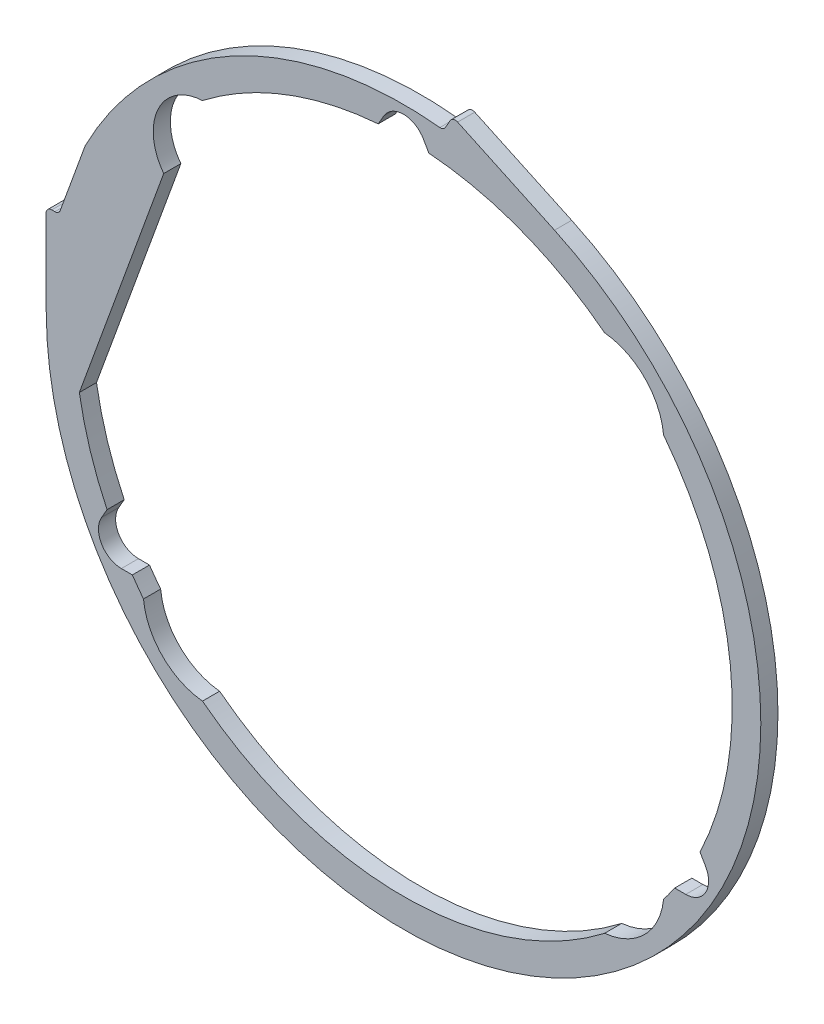
ISO-10303-21;
HEADER;
FILE_DESCRIPTION(('STEP AP214'),'2;1');
FILE_NAME('part.step','',(''),(''),'','','');
FILE_SCHEMA(('AUTOMOTIVE_DESIGN { 1 0 10303 214 1 1 1 1 }'));
ENDSEC;
DATA;
#1=APPLICATION_CONTEXT('core data for automotive mechanical design processes');
#2=APPLICATION_PROTOCOL_DEFINITION('international standard','automotive_design',2000,#1);
#3=PRODUCT_CONTEXT('',#1,'mechanical');
#4=PRODUCT('Part','Part','',(#3));
#5=PRODUCT_RELATED_PRODUCT_CATEGORY('part','',(#4));
#6=PRODUCT_DEFINITION_FORMATION('','',#4);
#7=PRODUCT_DEFINITION_CONTEXT('part definition',#1,'design');
#8=PRODUCT_DEFINITION('design','',#6,#7);
#9=PRODUCT_DEFINITION_SHAPE('','',#8);
#10=(LENGTH_UNIT() NAMED_UNIT(*) SI_UNIT(.MILLI.,.METRE.));
#11=(NAMED_UNIT(*) PLANE_ANGLE_UNIT() SI_UNIT($,.RADIAN.));
#12=(NAMED_UNIT(*) SI_UNIT($,.STERADIAN.) SOLID_ANGLE_UNIT());
#13=UNCERTAINTY_MEASURE_WITH_UNIT(LENGTH_MEASURE(1.E-05),#10,'distance_accuracy_value','');
#14=(GEOMETRIC_REPRESENTATION_CONTEXT(3) GLOBAL_UNCERTAINTY_ASSIGNED_CONTEXT((#13)) GLOBAL_UNIT_ASSIGNED_CONTEXT((#10,
#11,#12)) REPRESENTATION_CONTEXT('',''));
#15=CARTESIAN_POINT('',(0.,0.,0.));
#16=DIRECTION('',(0.,0.,1.));
#17=DIRECTION('',(1.,0.,0.));
#18=AXIS2_PLACEMENT_3D('',#15,#16,#17);
#19=CARTESIAN_POINT('',(-120.579344739041,31.5,5.99999999999995));
#20=DIRECTION('',(-0.939692620785907,0.342020143325672,0.));
#21=DIRECTION('',(-0.342020143325672,-0.939692620785907,0.));
#22=AXIS2_PLACEMENT_3D('',#19,#20,#21);
#23=PLANE('',#22);
#24=DIRECTION('',(0.,0.,1.));
#25=VECTOR('',#24,1.);
#26=CARTESIAN_POINT('',(-111.465659693336,56.5396438710967,5.99999999999995));
#27=LINE('',#26,#25);
#28=CARTESIAN_POINT('',(-111.465659693336,56.5396438710967,0.));
#29=VERTEX_POINT('',#28);
#30=CARTESIAN_POINT('',(-111.465659693336,56.5396438710967,5.99999999999995));
#31=VERTEX_POINT('',#30);
#32=EDGE_CURVE('E11',#29,#31,#27,.T.);
#33=ORIENTED_EDGE('',*,*,#32,.F.);
#34=DIRECTION('',(-0.342020143325672,-0.939692620785907,0.));
#35=VECTOR('',#34,1.);
#36=CARTESIAN_POINT('',(-120.579344739041,31.5,0.));
#37=LINE('',#36,#35);
#38=CARTESIAN_POINT('',(-120.100374573889,32.8159597133486,0.));
#39=VERTEX_POINT('',#38);
#40=EDGE_CURVE('E186',#29,#39,#37,.T.);
#41=ORIENTED_EDGE('',*,*,#40,.T.);
#42=DIRECTION('',(0.,0.,1.));
#43=VECTOR('',#42,1.);
#44=CARTESIAN_POINT('',(-120.100374573889,32.8159597133486,6.00000000000006));
#45=LINE('',#44,#43);
#46=CARTESIAN_POINT('',(-120.100374573889,32.8159597133486,6.00000000000006));
#47=VERTEX_POINT('',#46);
#48=EDGE_CURVE('E53',#39,#47,#45,.T.);
#49=ORIENTED_EDGE('',*,*,#48,.T.);
#50=DIRECTION('',(-0.342020143325672,-0.939692620785907,0.));
#51=VECTOR('',#50,1.);
#52=CARTESIAN_POINT('',(-120.579344739041,31.5,5.99999999999995));
#53=LINE('',#52,#51);
#54=EDGE_CURVE('E331',#31,#47,#53,.T.);
#55=ORIENTED_EDGE('',*,*,#54,.F.);
#56=EDGE_LOOP('',(#33,#41,#49,#55));
#57=FACE_BOUND('',#56,.T.);
#58=ADVANCED_FACE('F43',(#57),#23,.T.);
#59=CARTESIAN_POINT('',(-121.97975981546,33.5,6.00000000000001));
#60=DIRECTION('',(0.,0.,1.));
#61=DIRECTION('',(1.,0.,0.));
#62=AXIS2_PLACEMENT_3D('',#59,#60,#61);
#63=CYLINDRICAL_SURFACE('',#62,2.);
#64=ORIENTED_EDGE('',*,*,#48,.F.);
#65=CARTESIAN_POINT('',(-121.97975981546,33.5,0.));
#66=DIRECTION('',(0.,0.,1.));
#67=DIRECTION('',(1.,0.,0.));
#68=AXIS2_PLACEMENT_3D('',#65,#66,#67);
#69=CIRCLE('',#68,2.);
#70=CARTESIAN_POINT('',(-121.97975981546,31.5,0.));
#71=VERTEX_POINT('',#70);
#72=EDGE_CURVE('E234',#39,#71,#69,.F.);
#73=ORIENTED_EDGE('',*,*,#72,.T.);
#74=DIRECTION('',(0.,0.,1.));
#75=VECTOR('',#74,1.);
#76=CARTESIAN_POINT('',(-121.97975981546,31.5,6.00000000000001));
#77=LINE('',#76,#75);
#78=CARTESIAN_POINT('',(-121.97975981546,31.5,6.00000000000001));
#79=VERTEX_POINT('',#78);
#80=EDGE_CURVE('E324',#71,#79,#77,.T.);
#81=ORIENTED_EDGE('',*,*,#80,.T.);
#82=CARTESIAN_POINT('',(-121.97975981546,33.5,6.00000000000001));
#83=DIRECTION('',(0.,0.,1.));
#84=DIRECTION('',(1.,0.,0.));
#85=AXIS2_PLACEMENT_3D('',#82,#83,#84);
#86=CIRCLE('',#85,2.);
#87=EDGE_CURVE('E340',#47,#79,#86,.F.);
#88=ORIENTED_EDGE('',*,*,#87,.F.);
#89=EDGE_LOOP('',(#64,#73,#81,#88));
#90=FACE_BOUND('',#89,.T.);
#91=ADVANCED_FACE('F344',(#90),#63,.F.);
#92=CARTESIAN_POINT('',(-120.579344739041,31.5,5.99999999999995));
#93=DIRECTION('',(0.,1.,0.));
#94=DIRECTION('',(-1.,0.,0.));
#95=AXIS2_PLACEMENT_3D('',#92,#93,#94);
#96=PLANE('',#95);
#97=ORIENTED_EDGE('',*,*,#80,.F.);
#98=DIRECTION('',(1.,0.,0.));
#99=VECTOR('',#98,1.);
#100=CARTESIAN_POINT('',(0.,31.5,0.));
#101=LINE('',#100,#99);
#102=CARTESIAN_POINT('',(-123.074325624735,31.5,0.));
#103=VERTEX_POINT('',#102);
#104=EDGE_CURVE('E230',#71,#103,#101,.F.);
#105=ORIENTED_EDGE('',*,*,#104,.T.);
#106=DIRECTION('',(0.,0.,1.));
#107=VECTOR('',#106,1.);
#108=CARTESIAN_POINT('',(-123.074325624735,31.5,6.00000000000006));
#109=LINE('',#108,#107);
#110=CARTESIAN_POINT('',(-123.074325624735,31.5,6.00000000000006));
#111=VERTEX_POINT('',#110);
#112=EDGE_CURVE('E321',#103,#111,#109,.T.);
#113=ORIENTED_EDGE('',*,*,#112,.T.);
#114=DIRECTION('',(-1.,0.,0.));
#115=VECTOR('',#114,1.);
#116=CARTESIAN_POINT('',(-120.579344739041,31.5,5.99999999999995));
#117=LINE('',#116,#115);
#118=EDGE_CURVE('E346',#79,#111,#117,.T.);
#119=ORIENTED_EDGE('',*,*,#118,.F.);
#120=EDGE_LOOP('',(#97,#105,#113,#119));
#121=FACE_BOUND('',#120,.T.);
#122=ADVANCED_FACE('F687',(#121),#96,.T.);
#123=CARTESIAN_POINT('',(-123.074325624735,29.5,6.00000000000006));
#124=DIRECTION('',(0.,0.,1.));
#125=DIRECTION('',(1.,0.,0.));
#126=AXIS2_PLACEMENT_3D('',#123,#124,#125);
#127=CYLINDRICAL_SURFACE('',#126,2.);
#128=ORIENTED_EDGE('',*,*,#112,.F.);
#129=CARTESIAN_POINT('',(-123.074325624735,29.5,0.));
#130=DIRECTION('',(0.,0.,1.));
#131=DIRECTION('',(1.,0.,0.));
#132=AXIS2_PLACEMENT_3D('',#129,#130,#131);
#133=CIRCLE('',#132,2.);
#134=CARTESIAN_POINT('',(-125.074319342643,29.4949871835515,0.));
#135=VERTEX_POINT('',#134);
#136=EDGE_CURVE('E226',#103,#135,#133,.T.);
#137=ORIENTED_EDGE('',*,*,#136,.T.);
#138=DIRECTION('',(0.,0.,1.));
#139=VECTOR('',#138,1.);
#140=CARTESIAN_POINT('',(-125.074319342643,29.4949871835515,6.00000000000001));
#141=LINE('',#140,#139);
#142=CARTESIAN_POINT('',(-125.074319342643,29.4949871835515,6.00000000000001));
#143=VERTEX_POINT('',#142);
#144=EDGE_CURVE('E318',#135,#143,#141,.T.);
#145=ORIENTED_EDGE('',*,*,#144,.T.);
#146=CARTESIAN_POINT('',(-123.074325624735,29.5,6.00000000000006));
#147=DIRECTION('',(0.,0.,1.));
#148=DIRECTION('',(1.,0.,0.));
#149=AXIS2_PLACEMENT_3D('',#146,#147,#148);
#150=CIRCLE('',#149,2.);
#151=EDGE_CURVE('E350',#111,#143,#150,.T.);
#152=ORIENTED_EDGE('',*,*,#151,.F.);
#153=EDGE_LOOP('',(#128,#137,#145,#152));
#154=FACE_BOUND('',#153,.T.);
#155=ADVANCED_FACE('F692',(#154),#127,.T.);
#156=CARTESIAN_POINT('',(-125.079344739041,31.5,6.00000000000006));
#157=DIRECTION('',(-0.999996858953974,-0.00250640822420062,0.));
#158=DIRECTION('',(0.00250640822420062,-0.999996858953974,0.));
#159=AXIS2_PLACEMENT_3D('',#156,#157,#158);
#160=PLANE('',#159);
#161=ORIENTED_EDGE('',*,*,#144,.F.);
#162=DIRECTION('',(0.00250640822420062,-0.999996858953974,0.));
#163=VECTOR('',#162,1.);
#164=CARTESIAN_POINT('',(-125.079344739041,31.5,0.));
#165=LINE('',#164,#163);
#166=CARTESIAN_POINT('',(-124.999607369247,-0.31330102802507,0.));
#167=VERTEX_POINT('',#166);
#168=EDGE_CURVE('E222',#135,#167,#165,.T.);
#169=ORIENTED_EDGE('',*,*,#168,.T.);
#170=DIRECTION('',(0.,0.,1.));
#171=VECTOR('',#170,1.);
#172=CARTESIAN_POINT('',(-124.999607369247,-0.31330102802507,6.00000000000001));
#173=LINE('',#172,#171);
#174=CARTESIAN_POINT('',(-124.999607369247,-0.31330102802507,6.00000000000001));
#175=VERTEX_POINT('',#174);
#176=EDGE_CURVE('E315',#167,#175,#173,.T.);
#177=ORIENTED_EDGE('',*,*,#176,.T.);
#178=DIRECTION('',(0.00250640822420062,-0.999996858953974,0.));
#179=VECTOR('',#178,1.);
#180=CARTESIAN_POINT('',(-125.079344739041,31.5,6.00000000000006));
#181=LINE('',#180,#179);
#182=EDGE_CURVE('E357',#143,#175,#181,.T.);
#183=ORIENTED_EDGE('',*,*,#182,.F.);
#184=EDGE_LOOP('',(#161,#169,#177,#183));
#185=FACE_BOUND('',#184,.T.);
#186=ADVANCED_FACE('F696',(#185),#160,.T.);
#187=CARTESIAN_POINT('',(0.,0.,6.00000000000001));
#188=DIRECTION('',(0.,0.,1.));
#189=DIRECTION('',(1.,0.,0.));
#190=AXIS2_PLACEMENT_3D('',#187,#188,#189);
#191=CYLINDRICAL_SURFACE('',#190,125.);
#192=ORIENTED_EDGE('',*,*,#176,.F.);
#193=CARTESIAN_POINT('',(0.,0.,0.));
#194=DIRECTION('',(0.,0.,1.));
#195=DIRECTION('',(1.,0.,0.));
#196=AXIS2_PLACEMENT_3D('',#193,#194,#195);
#197=CIRCLE('',#196,125.);
#198=CARTESIAN_POINT('',(52.8272827175867,113.288473379582,0.));
#199=VERTEX_POINT('',#198);
#200=EDGE_CURVE('E218',#167,#199,#197,.T.);
#201=ORIENTED_EDGE('',*,*,#200,.T.);
#202=DIRECTION('',(0.,0.,1.));
#203=VECTOR('',#202,1.);
#204=CARTESIAN_POINT('',(52.8272827175867,113.288473379582,6.00000000000001));
#205=LINE('',#204,#203);
#206=CARTESIAN_POINT('',(52.8272827175867,113.288473379582,6.00000000000001));
#207=VERTEX_POINT('',#206);
#208=EDGE_CURVE('E312',#199,#207,#205,.T.);
#209=ORIENTED_EDGE('',*,*,#208,.T.);
#210=CARTESIAN_POINT('',(0.,0.,6.00000000000001));
#211=DIRECTION('',(0.,0.,1.));
#212=DIRECTION('',(-1.,0.,0.));
#213=AXIS2_PLACEMENT_3D('',#210,#211,#212);
#214=CIRCLE('',#213,125.);
#215=EDGE_CURVE('E361',#175,#207,#214,.T.);
#216=ORIENTED_EDGE('',*,*,#215,.F.);
#217=EDGE_LOOP('',(#192,#201,#209,#216));
#218=FACE_BOUND('',#217,.T.);
#219=ADVANCED_FACE('F700',(#218),#191,.T.);
#220=CARTESIAN_POINT('',(52.8272827175867,113.288473379582,5.99999999999995));
#221=DIRECTION('',(0.422618261740693,0.906307787036653,0.));
#222=DIRECTION('',(-0.906307787036653,0.422618261740693,0.));
#223=AXIS2_PLACEMENT_3D('',#220,#221,#222);
#224=PLANE('',#223);
#225=ORIENTED_EDGE('',*,*,#208,.F.);
#226=DIRECTION('',(-0.906307787036653,0.422618261740693,0.));
#227=VECTOR('',#226,1.);
#228=CARTESIAN_POINT('',(52.8272827175867,113.288473379582,0.));
#229=LINE('',#228,#227);
#230=CARTESIAN_POINT('',(18.9272145650923,129.096334771066,0.));
#231=VERTEX_POINT('',#230);
#232=EDGE_CURVE('E214',#199,#231,#229,.T.);
#233=ORIENTED_EDGE('',*,*,#232,.T.);
#234=DIRECTION('',(0.,0.,1.));
#235=VECTOR('',#234,1.);
#236=CARTESIAN_POINT('',(18.9272145650923,129.096334771066,5.99999999999995));
#237=LINE('',#236,#235);
#238=CARTESIAN_POINT('',(18.9272145650923,129.096334771066,5.99999999999995));
#239=VERTEX_POINT('',#238);
#240=EDGE_CURVE('E309',#231,#239,#237,.T.);
#241=ORIENTED_EDGE('',*,*,#240,.T.);
#242=DIRECTION('',(-0.906307787036653,0.422618261740693,0.));
#243=VECTOR('',#242,1.);
#244=CARTESIAN_POINT('',(52.8272827175867,113.288473379582,5.99999999999995));
#245=LINE('',#244,#243);
#246=EDGE_CURVE('E365',#207,#239,#245,.T.);
#247=ORIENTED_EDGE('',*,*,#246,.F.);
#248=EDGE_LOOP('',(#225,#233,#241,#247));
#249=FACE_BOUND('',#248,.T.);
#250=ADVANCED_FACE('F704',(#249),#224,.T.);
#251=CARTESIAN_POINT('',(18.0819780416109,127.283719196992,6.00000000000001));
#252=DIRECTION('',(0.,0.,1.));
#253=DIRECTION('',(1.,0.,0.));
#254=AXIS2_PLACEMENT_3D('',#251,#252,#253);
#255=CYLINDRICAL_SURFACE('',#254,2.);
#256=ORIENTED_EDGE('',*,*,#240,.F.);
#257=CARTESIAN_POINT('',(18.0819780416109,127.283719196992,0.));
#258=DIRECTION('',(0.,0.,1.));
#259=DIRECTION('',(1.,0.,0.));
#260=AXIS2_PLACEMENT_3D('',#257,#258,#259);
#261=CIRCLE('',#260,2.);
#262=CARTESIAN_POINT('',(16.349927234042,128.283719196993,0.));
#263=VERTEX_POINT('',#262);
#264=EDGE_CURVE('E210',#231,#263,#261,.T.);
#265=ORIENTED_EDGE('',*,*,#264,.T.);
#266=DIRECTION('',(0.,0.,1.));
#267=VECTOR('',#266,1.);
#268=CARTESIAN_POINT('',(16.349927234042,128.283719196993,6.00000000000001));
#269=LINE('',#268,#267);
#270=CARTESIAN_POINT('',(16.349927234042,128.283719196993,6.00000000000001));
#271=VERTEX_POINT('',#270);
#272=EDGE_CURVE('E306',#263,#271,#269,.T.);
#273=ORIENTED_EDGE('',*,*,#272,.T.);
#274=CARTESIAN_POINT('',(18.0819780416109,127.283719196992,6.00000000000001));
#275=DIRECTION('',(0.,0.,1.));
#276=DIRECTION('',(1.,0.,0.));
#277=AXIS2_PLACEMENT_3D('',#274,#275,#276);
#278=CIRCLE('',#277,2.);
#279=EDGE_CURVE('E369',#239,#271,#278,.T.);
#280=ORIENTED_EDGE('',*,*,#279,.F.);
#281=EDGE_LOOP('',(#256,#265,#273,#280));
#282=FACE_BOUND('',#281,.T.);
#283=ADVANCED_FACE('F484',(#282),#255,.T.);
#284=CARTESIAN_POINT('',(14.,124.213525833542,6.00000000000001));
#285=DIRECTION('',(-0.866025403784437,0.500000000000004,0.));
#286=DIRECTION('',(-0.500000000000004,-0.866025403784437,0.));
#287=AXIS2_PLACEMENT_3D('',#284,#285,#286);
#288=PLANE('',#287);
#289=ORIENTED_EDGE('',*,*,#272,.F.);
#290=DIRECTION('',(-0.500000000000004,-0.866025403784437,0.));
#291=VECTOR('',#290,1.);
#292=CARTESIAN_POINT('',(14.,124.213525833542,0.));
#293=LINE('',#292,#291);
#294=CARTESIAN_POINT('',(14.6510636458252,125.341201147072,0.));
#295=VERTEX_POINT('',#294);
#296=EDGE_CURVE('E206',#263,#295,#293,.T.);
#297=ORIENTED_EDGE('',*,*,#296,.T.);
#298=DIRECTION('',(0.,0.,1.));
#299=VECTOR('',#298,1.);
#300=CARTESIAN_POINT('',(14.6510636458252,125.341201147072,6.00000000000001));
#301=LINE('',#300,#299);
#302=CARTESIAN_POINT('',(14.6510636458252,125.341201147072,6.00000000000001));
#303=VERTEX_POINT('',#302);
#304=EDGE_CURVE('E304',#295,#303,#301,.T.);
#305=ORIENTED_EDGE('',*,*,#304,.T.);
#306=DIRECTION('',(-0.500000000000004,-0.866025403784437,0.));
#307=VECTOR('',#306,1.);
#308=CARTESIAN_POINT('',(14.,124.213525833542,6.00000000000001));
#309=LINE('',#308,#307);
#310=EDGE_CURVE('E373',#271,#303,#309,.T.);
#311=ORIENTED_EDGE('',*,*,#310,.F.);
#312=EDGE_LOOP('',(#289,#297,#305,#311));
#313=FACE_BOUND('',#312,.T.);
#314=ADVANCED_FACE('F490',(#313),#288,.T.);
#315=CARTESIAN_POINT('',(12.9190128382564,126.341201147072,6.00000000000001));
#316=DIRECTION('',(0.,0.,1.));
#317=DIRECTION('',(1.,0.,0.));
#318=AXIS2_PLACEMENT_3D('',#315,#316,#317);
#319=CYLINDRICAL_SURFACE('',#318,2.);
#320=ORIENTED_EDGE('',*,*,#304,.F.);
#321=CARTESIAN_POINT('',(12.9190128382564,126.341201147072,0.));
#322=DIRECTION('',(0.,0.,1.));
#323=DIRECTION('',(1.,0.,0.));
#324=AXIS2_PLACEMENT_3D('',#321,#322,#323);
#325=CIRCLE('',#324,2.);
#326=CARTESIAN_POINT('',(12.7155638171814,124.351575932158,0.));
#327=VERTEX_POINT('',#326);
#328=EDGE_CURVE('E202',#295,#327,#325,.F.);
#329=ORIENTED_EDGE('',*,*,#328,.T.);
#330=DIRECTION('',(0.,0.,1.));
#331=VECTOR('',#330,1.);
#332=CARTESIAN_POINT('',(12.7155638171814,124.351575932158,6.00000000000001));
#333=LINE('',#332,#331);
#334=CARTESIAN_POINT('',(12.7155638171814,124.351575932158,6.00000000000001));
#335=VERTEX_POINT('',#334);
#336=EDGE_CURVE('E61',#327,#335,#333,.T.);
#337=ORIENTED_EDGE('',*,*,#336,.T.);
#338=CARTESIAN_POINT('',(12.9190128382564,126.341201147072,6.00000000000001));
#339=DIRECTION('',(0.,0.,1.));
#340=DIRECTION('',(1.,0.,0.));
#341=AXIS2_PLACEMENT_3D('',#338,#339,#340);
#342=CIRCLE('',#341,2.);
#343=EDGE_CURVE('E302',#303,#335,#342,.F.);
#344=ORIENTED_EDGE('',*,*,#343,.F.);
#345=EDGE_LOOP('',(#320,#329,#337,#344));
#346=FACE_BOUND('',#345,.T.);
#347=ADVANCED_FACE('F491',(#346),#319,.F.);
#348=CARTESIAN_POINT('',(0.,0.,6.00000000000001));
#349=DIRECTION('',(0.,0.,1.));
#350=DIRECTION('',(1.,0.,0.));
#351=AXIS2_PLACEMENT_3D('',#348,#349,#350);
#352=CYLINDRICAL_SURFACE('',#351,125.);
#353=ORIENTED_EDGE('',*,*,#336,.F.);
#354=CARTESIAN_POINT('',(0.,0.,0.));
#355=DIRECTION('',(0.,0.,1.));
#356=DIRECTION('',(1.,0.,0.));
#357=AXIS2_PLACEMENT_3D('',#354,#355,#356);
#358=CIRCLE('',#357,125.);
#359=CARTESIAN_POINT('',(-111.368165093256,56.7638247809404,0.));
#360=VERTEX_POINT('',#359);
#361=EDGE_CURVE('E184',#327,#360,#358,.T.);
#362=ORIENTED_EDGE('',*,*,#361,.T.);
#363=DIRECTION('',(0.,0.,1.));
#364=VECTOR('',#363,1.);
#365=CARTESIAN_POINT('',(-111.368165093256,56.7638247809404,6.00000000000001));
#366=LINE('',#365,#364);
#367=CARTESIAN_POINT('',(-111.368165093256,56.7638247809404,6.00000000000001));
#368=VERTEX_POINT('',#367);
#369=EDGE_CURVE('E47',#360,#368,#366,.T.);
#370=ORIENTED_EDGE('',*,*,#369,.T.);
#371=CARTESIAN_POINT('',(0.,0.,6.00000000000001));
#372=DIRECTION('',(0.,0.,1.));
#373=DIRECTION('',(1.,0.,0.));
#374=AXIS2_PLACEMENT_3D('',#371,#372,#373);
#375=CIRCLE('',#374,125.);
#376=EDGE_CURVE('E492',#335,#368,#375,.T.);
#377=ORIENTED_EDGE('',*,*,#376,.F.);
#378=EDGE_LOOP('',(#353,#362,#370,#377));
#379=FACE_BOUND('',#378,.T.);
#380=ADVANCED_FACE('F189',(#379),#352,.T.);
#381=CARTESIAN_POINT('',(-83.90361394427,62.0944365967156,6.00000000000001));
#382=DIRECTION('',(-0.939692620785907,0.342020143325672,0.));
#383=DIRECTION('',(-0.342020143325672,-0.939692620785907,0.));
#384=AXIS2_PLACEMENT_3D('',#381,#382,#383);
#385=PLANE('',#384);
#386=DIRECTION('',(0.,0.,1.));
#387=VECTOR('',#386,1.);
#388=CARTESIAN_POINT('',(-113.419575030063,-19.,6.00000000000001));
#389=LINE('',#388,#387);
#390=CARTESIAN_POINT('',(-113.419575030063,-19.,0.));
#391=VERTEX_POINT('',#390);
#392=CARTESIAN_POINT('',(-113.419575030063,-19.,6.00000000000001));
#393=VERTEX_POINT('',#392);
#394=EDGE_CURVE('E179',#391,#393,#389,.T.);
#395=ORIENTED_EDGE('',*,*,#394,.F.);
#396=DIRECTION('',(-0.342020143325672,-0.939692620785907,0.));
#397=VECTOR('',#396,1.);
#398=CARTESIAN_POINT('',(-83.90361394427,62.0944365967156,0.));
#399=LINE('',#398,#397);
#400=CARTESIAN_POINT('',(-83.90361394427,62.0944365967156,0.));
#401=VERTEX_POINT('',#400);
#402=EDGE_CURVE('E441',#401,#391,#399,.T.);
#403=ORIENTED_EDGE('',*,*,#402,.F.);
#404=DIRECTION('',(0.,0.,1.));
#405=VECTOR('',#404,1.);
#406=CARTESIAN_POINT('',(-83.90361394427,62.0944365967156,6.00000000000001));
#407=LINE('',#406,#405);
#408=CARTESIAN_POINT('',(-83.90361394427,62.0944365967156,6.00000000000001));
#409=VERTEX_POINT('',#408);
#410=EDGE_CURVE('E295',#401,#409,#407,.T.);
#411=ORIENTED_EDGE('',*,*,#410,.T.);
#412=DIRECTION('',(-0.342020143325672,-0.939692620785907,0.));
#413=VECTOR('',#412,1.);
#414=CARTESIAN_POINT('',(-83.90361394427,62.0944365967156,6.00000000000001));
#415=LINE('',#414,#413);
#416=EDGE_CURVE('E537',#409,#393,#415,.T.);
#417=ORIENTED_EDGE('',*,*,#416,.T.);
#418=EDGE_LOOP('',(#395,#403,#411,#417));
#419=FACE_BOUND('',#418,.T.);
#420=ADVANCED_FACE('F625',(#419),#385,.F.);
#421=CARTESIAN_POINT('',(-69.5775173450919,72.9922784120026,6.00000000000001));
#422=DIRECTION('',(0.,0.,1.));
#423=DIRECTION('',(1.,0.,0.));
#424=AXIS2_PLACEMENT_3D('',#421,#422,#423);
#425=CYLINDRICAL_SURFACE('',#424,18.);
#426=ORIENTED_EDGE('',*,*,#410,.F.);
#427=CARTESIAN_POINT('',(-69.5775173450919,72.9922784120026,0.));
#428=DIRECTION('',(0.,0.,-1.));
#429=DIRECTION('',(-1.,0.,0.));
#430=AXIS2_PLACEMENT_3D('',#427,#428,#429);
#431=CIRCLE('',#430,18.);
#432=CARTESIAN_POINT('',(-70.3447363216833,90.9759202857155,0.));
#433=VERTEX_POINT('',#432);
#434=EDGE_CURVE('E438',#433,#401,#431,.F.);
#435=ORIENTED_EDGE('',*,*,#434,.F.);
#436=DIRECTION('',(0.,0.,1.));
#437=VECTOR('',#436,1.);
#438=CARTESIAN_POINT('',(-70.3447363216833,90.9759202857155,6.00000000000001));
#439=LINE('',#438,#437);
#440=CARTESIAN_POINT('',(-70.3447363216833,90.9759202857155,6.00000000000001));
#441=VERTEX_POINT('',#440);
#442=EDGE_CURVE('E292',#433,#441,#439,.T.);
#443=ORIENTED_EDGE('',*,*,#442,.T.);
#444=CARTESIAN_POINT('',(-69.5775173450919,72.9922784120026,6.00000000000001));
#445=DIRECTION('',(0.,0.,-1.));
#446=DIRECTION('',(-1.,0.,0.));
#447=AXIS2_PLACEMENT_3D('',#444,#445,#446);
#448=CIRCLE('',#447,18.);
#449=EDGE_CURVE('E532',#441,#409,#448,.F.);
#450=ORIENTED_EDGE('',*,*,#449,.T.);
#451=EDGE_LOOP('',(#426,#435,#443,#450));
#452=FACE_BOUND('',#451,.T.);
#453=ADVANCED_FACE('F628',(#452),#425,.F.);
#454=CARTESIAN_POINT('',(0.,0.,6.00000000000001));
#455=DIRECTION('',(0.,0.,1.));
#456=DIRECTION('',(1.,0.,0.));
#457=AXIS2_PLACEMENT_3D('',#454,#455,#456);
#458=CYLINDRICAL_SURFACE('',#457,115.);
#459=ORIENTED_EDGE('',*,*,#442,.F.);
#460=CARTESIAN_POINT('',(0.,0.,0.));
#461=DIRECTION('',(0.,0.,1.));
#462=DIRECTION('',(1.,0.,0.));
#463=AXIS2_PLACEMENT_3D('',#460,#461,#462);
#464=CIRCLE('',#463,115.);
#465=CARTESIAN_POINT('',(-8.85748634346279,114.658383625775,0.));
#466=VERTEX_POINT('',#465);
#467=EDGE_CURVE('E434',#466,#433,#464,.T.);
#468=ORIENTED_EDGE('',*,*,#467,.F.);
#469=DIRECTION('',(0.,0.,1.));
#470=VECTOR('',#469,1.);
#471=CARTESIAN_POINT('',(-8.85748634346279,114.658383625775,6.00000000000006));
#472=LINE('',#471,#470);
#473=CARTESIAN_POINT('',(-8.85748634346279,114.658383625775,6.00000000000006));
#474=VERTEX_POINT('',#473);
#475=EDGE_CURVE('E289',#466,#474,#472,.T.);
#476=ORIENTED_EDGE('',*,*,#475,.T.);
#477=CARTESIAN_POINT('',(0.,0.,6.00000000000001));
#478=DIRECTION('',(0.,0.,1.));
#479=DIRECTION('',(-1.,0.,0.));
#480=AXIS2_PLACEMENT_3D('',#477,#478,#479);
#481=CIRCLE('',#480,115.);
#482=EDGE_CURVE('E536',#474,#441,#481,.T.);
#483=ORIENTED_EDGE('',*,*,#482,.T.);
#484=EDGE_LOOP('',(#459,#468,#476,#483));
#485=FACE_BOUND('',#484,.T.);
#486=ADVANCED_FACE('F632',(#485),#458,.F.);
#487=CARTESIAN_POINT('',(-105.655099261702,-53.,6.00000000000006));
#488=DIRECTION('',(0.866025403784439,-0.5,0.));
#489=DIRECTION('',(0.5,0.866025403784439,0.));
#490=AXIS2_PLACEMENT_3D('',#487,#488,#489);
#491=PLANE('',#490);
#492=ORIENTED_EDGE('',*,*,#475,.F.);
#493=DIRECTION('',(0.5,0.866025403784439,0.));
#494=VECTOR('',#493,1.);
#495=CARTESIAN_POINT('',(-105.655099261702,-53.,0.));
#496=LINE('',#495,#494);
#497=CARTESIAN_POINT('',(-6.9282032302755,118.,0.));
#498=VERTEX_POINT('',#497);
#499=EDGE_CURVE('E431',#466,#498,#496,.T.);
#500=ORIENTED_EDGE('',*,*,#499,.T.);
#501=DIRECTION('',(0.,0.,1.));
#502=VECTOR('',#501,1.);
#503=CARTESIAN_POINT('',(-6.9282032302755,118.,6.00000000000006));
#504=LINE('',#503,#502);
#505=CARTESIAN_POINT('',(-6.9282032302755,118.,6.00000000000006));
#506=VERTEX_POINT('',#505);
#507=EDGE_CURVE('E286',#498,#506,#504,.T.);
#508=ORIENTED_EDGE('',*,*,#507,.T.);
#509=DIRECTION('',(0.5,0.866025403784439,0.));
#510=VECTOR('',#509,1.);
#511=CARTESIAN_POINT('',(-105.655099261702,-53.,6.00000000000006));
#512=LINE('',#511,#510);
#513=EDGE_CURVE('E531',#474,#506,#512,.T.);
#514=ORIENTED_EDGE('',*,*,#513,.F.);
#515=EDGE_LOOP('',(#492,#500,#508,#514));
#516=FACE_BOUND('',#515,.T.);
#517=ADVANCED_FACE('F634',(#516),#491,.T.);
#518=CARTESIAN_POINT('',(0.,114.,6.00000000000006));
#519=DIRECTION('',(0.,0.,1.));
#520=DIRECTION('',(1.,0.,0.));
#521=AXIS2_PLACEMENT_3D('',#518,#519,#520);
#522=CYLINDRICAL_SURFACE('',#521,8.);
#523=ORIENTED_EDGE('',*,*,#507,.F.);
#524=CARTESIAN_POINT('',(0.,114.,0.));
#525=DIRECTION('',(0.,0.,-1.));
#526=DIRECTION('',(-1.,0.,0.));
#527=AXIS2_PLACEMENT_3D('',#524,#525,#526);
#528=CIRCLE('',#527,8.);
#529=CARTESIAN_POINT('',(6.92820323027552,118.,0.));
#530=VERTEX_POINT('',#529);
#531=EDGE_CURVE('E428',#498,#530,#528,.T.);
#532=ORIENTED_EDGE('',*,*,#531,.T.);
#533=DIRECTION('',(0.,0.,1.));
#534=VECTOR('',#533,1.);
#535=CARTESIAN_POINT('',(6.92820323027552,118.,6.00000000000006));
#536=LINE('',#535,#534);
#537=CARTESIAN_POINT('',(6.92820323027552,118.,6.00000000000006));
#538=VERTEX_POINT('',#537);
#539=EDGE_CURVE('E283',#530,#538,#536,.T.);
#540=ORIENTED_EDGE('',*,*,#539,.T.);
#541=CARTESIAN_POINT('',(0.,114.,6.00000000000006));
#542=DIRECTION('',(0.,0.,-1.));
#543=DIRECTION('',(-1.,0.,0.));
#544=AXIS2_PLACEMENT_3D('',#541,#542,#543);
#545=CIRCLE('',#544,8.);
#546=EDGE_CURVE('E528',#506,#538,#545,.T.);
#547=ORIENTED_EDGE('',*,*,#546,.F.);
#548=EDGE_LOOP('',(#523,#532,#540,#547));
#549=FACE_BOUND('',#548,.T.);
#550=ADVANCED_FACE('F636',(#549),#522,.F.);
#551=CARTESIAN_POINT('',(6.92820323027552,118.,6.00000000000006));
#552=DIRECTION('',(-0.866025403784439,-0.5,0.));
#553=DIRECTION('',(0.5,-0.866025403784439,0.));
#554=AXIS2_PLACEMENT_3D('',#551,#552,#553);
#555=PLANE('',#554);
#556=ORIENTED_EDGE('',*,*,#539,.F.);
#557=DIRECTION('',(0.5,-0.866025403784439,0.));
#558=VECTOR('',#557,1.);
#559=CARTESIAN_POINT('',(6.92820323027552,118.,0.));
#560=LINE('',#559,#558);
#561=CARTESIAN_POINT('',(8.8574863434628,114.658383625775,0.));
#562=VERTEX_POINT('',#561);
#563=EDGE_CURVE('E425',#530,#562,#560,.T.);
#564=ORIENTED_EDGE('',*,*,#563,.T.);
#565=DIRECTION('',(0.,0.,1.));
#566=VECTOR('',#565,1.);
#567=CARTESIAN_POINT('',(8.8574863434628,114.658383625775,6.00000000000006));
#568=LINE('',#567,#566);
#569=CARTESIAN_POINT('',(8.8574863434628,114.658383625775,6.00000000000006));
#570=VERTEX_POINT('',#569);
#571=EDGE_CURVE('E280',#562,#570,#568,.T.);
#572=ORIENTED_EDGE('',*,*,#571,.T.);
#573=DIRECTION('',(0.5,-0.866025403784439,0.));
#574=VECTOR('',#573,1.);
#575=CARTESIAN_POINT('',(6.92820323027552,118.,6.00000000000006));
#576=LINE('',#575,#574);
#577=EDGE_CURVE('E525',#538,#570,#576,.T.);
#578=ORIENTED_EDGE('',*,*,#577,.F.);
#579=EDGE_LOOP('',(#556,#564,#572,#578));
#580=FACE_BOUND('',#579,.T.);
#581=ADVANCED_FACE('F640',(#580),#555,.T.);
#582=ORIENTED_EDGE('',*,*,#571,.F.);
#583=CARTESIAN_POINT('',(0.,0.,0.));
#584=DIRECTION('',(0.,0.,1.));
#585=DIRECTION('',(1.,0.,0.));
#586=AXIS2_PLACEMENT_3D('',#583,#584,#585);
#587=CIRCLE('',#586,115.);
#588=CARTESIAN_POINT('',(70.3447363216832,90.9759202857155,0.));
#589=VERTEX_POINT('',#588);
#590=EDGE_CURVE('E421',#589,#562,#587,.T.);
#591=ORIENTED_EDGE('',*,*,#590,.F.);
#592=DIRECTION('',(0.,0.,1.));
#593=VECTOR('',#592,1.);
#594=CARTESIAN_POINT('',(70.3447363216832,90.9759202857155,5.99999999999995));
#595=LINE('',#594,#593);
#596=CARTESIAN_POINT('',(70.3447363216832,90.9759202857155,5.99999999999995));
#597=VERTEX_POINT('',#596);
#598=EDGE_CURVE('E277',#589,#597,#595,.T.);
#599=ORIENTED_EDGE('',*,*,#598,.T.);
#600=EDGE_CURVE('E524',#597,#570,#481,.T.);
#601=ORIENTED_EDGE('',*,*,#600,.T.);
#602=EDGE_LOOP('',(#582,#591,#599,#601));
#603=FACE_BOUND('',#602,.T.);
#604=ADVANCED_FACE('F725',(#603),#458,.F.);
#605=CARTESIAN_POINT('',(68.0870008976154,68.0870008976161,5.99999999999995));
#606=DIRECTION('',(0.,0.,1.));
#607=DIRECTION('',(1.,0.,0.));
#608=AXIS2_PLACEMENT_3D('',#605,#606,#607);
#609=CYLINDRICAL_SURFACE('',#608,23.);
#610=ORIENTED_EDGE('',*,*,#598,.F.);
#611=CARTESIAN_POINT('',(68.0870008976154,68.0870008976161,0.));
#612=DIRECTION('',(0.,0.,-1.));
#613=DIRECTION('',(-1.,0.,0.));
#614=AXIS2_PLACEMENT_3D('',#611,#612,#613);
#615=CIRCLE('',#614,23.);
#616=CARTESIAN_POINT('',(90.9759202857147,70.3447363216843,0.));
#617=VERTEX_POINT('',#616);
#618=EDGE_CURVE('E417',#617,#589,#615,.F.);
#619=ORIENTED_EDGE('',*,*,#618,.F.);
#620=DIRECTION('',(0.,0.,1.));
#621=VECTOR('',#620,1.);
#622=CARTESIAN_POINT('',(90.9759202857147,70.3447363216843,6.00000000000001));
#623=LINE('',#622,#621);
#624=CARTESIAN_POINT('',(90.9759202857147,70.3447363216843,6.00000000000001));
#625=VERTEX_POINT('',#624);
#626=EDGE_CURVE('E274',#617,#625,#623,.T.);
#627=ORIENTED_EDGE('',*,*,#626,.T.);
#628=CARTESIAN_POINT('',(68.0870008976154,68.0870008976161,5.99999999999995));
#629=DIRECTION('',(0.,0.,-1.));
#630=DIRECTION('',(-1.,0.,0.));
#631=AXIS2_PLACEMENT_3D('',#628,#629,#630);
#632=CIRCLE('',#631,23.);
#633=EDGE_CURVE('E519',#625,#597,#632,.F.);
#634=ORIENTED_EDGE('',*,*,#633,.T.);
#635=EDGE_LOOP('',(#610,#619,#627,#634));
#636=FACE_BOUND('',#635,.T.);
#637=ADVANCED_FACE('F644',(#636),#609,.F.);
#638=ORIENTED_EDGE('',*,*,#626,.F.);
#639=CARTESIAN_POINT('',(0.,0.,0.));
#640=DIRECTION('',(0.,0.,1.));
#641=DIRECTION('',(1.,0.,0.));
#642=AXIS2_PLACEMENT_3D('',#639,#640,#641);
#643=CIRCLE('',#642,115.);
#644=CARTESIAN_POINT('',(103.725816148514,-49.6583836257749,0.));
#645=VERTEX_POINT('',#644);
#646=EDGE_CURVE('E413',#645,#617,#643,.T.);
#647=ORIENTED_EDGE('',*,*,#646,.F.);
#648=DIRECTION('',(0.,0.,1.));
#649=VECTOR('',#648,1.);
#650=CARTESIAN_POINT('',(103.725816148514,-49.6583836257749,6.00000000000001));
#651=LINE('',#650,#649);
#652=CARTESIAN_POINT('',(103.725816148514,-49.6583836257749,6.00000000000001));
#653=VERTEX_POINT('',#652);
#654=EDGE_CURVE('E271',#645,#653,#651,.T.);
#655=ORIENTED_EDGE('',*,*,#654,.T.);
#656=EDGE_CURVE('E523',#653,#625,#481,.T.);
#657=ORIENTED_EDGE('',*,*,#656,.T.);
#658=EDGE_LOOP('',(#638,#647,#655,#657));
#659=FACE_BOUND('',#658,.T.);
#660=ADVANCED_FACE('F647',(#659),#458,.F.);
#661=ORIENTED_EDGE('',*,*,#654,.F.);
#662=DIRECTION('',(0.5,-0.866025403784439,0.));
#663=VECTOR('',#662,1.);
#664=CARTESIAN_POINT('',(6.92820323027552,118.,0.));
#665=LINE('',#664,#663);
#666=CARTESIAN_POINT('',(105.655099261702,-53.0000000000001,0.));
#667=VERTEX_POINT('',#666);
#668=EDGE_CURVE('E410',#645,#667,#665,.T.);
#669=ORIENTED_EDGE('',*,*,#668,.T.);
#670=DIRECTION('',(0.,0.,1.));
#671=VECTOR('',#670,1.);
#672=CARTESIAN_POINT('',(105.655099261702,-53.0000000000001,6.00000000000006));
#673=LINE('',#672,#671);
#674=CARTESIAN_POINT('',(105.655099261702,-53.0000000000001,6.00000000000006));
#675=VERTEX_POINT('',#674);
#676=EDGE_CURVE('E268',#667,#675,#673,.T.);
#677=ORIENTED_EDGE('',*,*,#676,.T.);
#678=EDGE_CURVE('E518',#653,#675,#576,.T.);
#679=ORIENTED_EDGE('',*,*,#678,.F.);
#680=EDGE_LOOP('',(#661,#669,#677,#679));
#681=FACE_BOUND('',#680,.T.);
#682=ADVANCED_FACE('F652',(#681),#555,.T.);
#683=CARTESIAN_POINT('',(98.7268960314261,-57.0000000000001,6.00000000000006));
#684=DIRECTION('',(0.,0.,1.));
#685=DIRECTION('',(1.,0.,0.));
#686=AXIS2_PLACEMENT_3D('',#683,#684,#685);
#687=CYLINDRICAL_SURFACE('',#686,7.99999999999999);
#688=ORIENTED_EDGE('',*,*,#676,.F.);
#689=CARTESIAN_POINT('',(98.7268960314261,-57.0000000000001,0.));
#690=DIRECTION('',(0.,0.,-1.));
#691=DIRECTION('',(-1.,0.,0.));
#692=AXIS2_PLACEMENT_3D('',#689,#690,#691);
#693=CIRCLE('',#692,7.99999999999999);
#694=CARTESIAN_POINT('',(98.7268960314261,-65.0000000000001,0.));
#695=VERTEX_POINT('',#694);
#696=EDGE_CURVE('E407',#667,#695,#693,.T.);
#697=ORIENTED_EDGE('',*,*,#696,.T.);
#698=DIRECTION('',(0.,0.,1.));
#699=VECTOR('',#698,1.);
#700=CARTESIAN_POINT('',(98.7268960314261,-65.0000000000001,6.00000000000006));
#701=LINE('',#700,#699);
#702=CARTESIAN_POINT('',(98.7268960314261,-65.0000000000001,6.00000000000006));
#703=VERTEX_POINT('',#702);
#704=EDGE_CURVE('E265',#695,#703,#701,.T.);
#705=ORIENTED_EDGE('',*,*,#704,.T.);
#706=CARTESIAN_POINT('',(98.7268960314261,-57.0000000000001,6.00000000000006));
#707=DIRECTION('',(0.,0.,-1.));
#708=DIRECTION('',(1.,0.,0.));
#709=AXIS2_PLACEMENT_3D('',#706,#707,#708);
#710=CIRCLE('',#709,7.99999999999999);
#711=EDGE_CURVE('E515',#675,#703,#710,.T.);
#712=ORIENTED_EDGE('',*,*,#711,.F.);
#713=EDGE_LOOP('',(#688,#697,#705,#712));
#714=FACE_BOUND('',#713,.T.);
#715=ADVANCED_FACE('F657',(#714),#687,.F.);
#716=CARTESIAN_POINT('',(98.7268960314261,-65.0000000000001,6.00000000000006));
#717=DIRECTION('',(0.,1.,0.));
#718=DIRECTION('',(-1.,0.,0.));
#719=AXIS2_PLACEMENT_3D('',#716,#717,#718);
#720=PLANE('',#719);
#721=ORIENTED_EDGE('',*,*,#704,.F.);
#722=DIRECTION('',(1.,0.,0.));
#723=VECTOR('',#722,1.);
#724=CARTESIAN_POINT('',(0.,-65.0000000000001,0.));
#725=LINE('',#724,#723);
#726=CARTESIAN_POINT('',(94.8683298050514,-65.0000000000001,0.));
#727=VERTEX_POINT('',#726);
#728=EDGE_CURVE('E404',#695,#727,#725,.F.);
#729=ORIENTED_EDGE('',*,*,#728,.T.);
#730=DIRECTION('',(0.,0.,1.));
#731=VECTOR('',#730,1.);
#732=CARTESIAN_POINT('',(94.8683298050514,-65.0000000000001,6.00000000000006));
#733=LINE('',#732,#731);
#734=CARTESIAN_POINT('',(94.8683298050514,-65.0000000000001,6.00000000000006));
#735=VERTEX_POINT('',#734);
#736=EDGE_CURVE('E262',#727,#735,#733,.T.);
#737=ORIENTED_EDGE('',*,*,#736,.T.);
#738=DIRECTION('',(-1.,0.,0.));
#739=VECTOR('',#738,1.);
#740=CARTESIAN_POINT('',(98.7268960314261,-65.0000000000001,6.00000000000006));
#741=LINE('',#740,#739);
#742=EDGE_CURVE('E512',#703,#735,#741,.T.);
#743=ORIENTED_EDGE('',*,*,#742,.F.);
#744=EDGE_LOOP('',(#721,#729,#737,#743));
#745=FACE_BOUND('',#744,.T.);
#746=ADVANCED_FACE('F659',(#745),#720,.T.);
#747=ORIENTED_EDGE('',*,*,#736,.F.);
#748=CARTESIAN_POINT('',(0.,0.,0.));
#749=DIRECTION('',(0.,0.,1.));
#750=DIRECTION('',(1.,0.,0.));
#751=AXIS2_PLACEMENT_3D('',#748,#749,#750);
#752=CIRCLE('',#751,115.);
#753=CARTESIAN_POINT('',(90.9759202857153,-70.3447363216835,0.));
#754=VERTEX_POINT('',#753);
#755=EDGE_CURVE('E400',#754,#727,#752,.T.);
#756=ORIENTED_EDGE('',*,*,#755,.F.);
#757=DIRECTION('',(0.,0.,1.));
#758=VECTOR('',#757,1.);
#759=CARTESIAN_POINT('',(90.9759202857153,-70.3447363216835,6.00000000000001));
#760=LINE('',#759,#758);
#761=CARTESIAN_POINT('',(90.9759202857153,-70.3447363216835,6.00000000000001));
#762=VERTEX_POINT('',#761);
#763=EDGE_CURVE('E259',#754,#762,#760,.T.);
#764=ORIENTED_EDGE('',*,*,#763,.T.);
#765=EDGE_CURVE('E511',#762,#735,#481,.T.);
#766=ORIENTED_EDGE('',*,*,#765,.T.);
#767=EDGE_LOOP('',(#747,#756,#764,#766));
#768=FACE_BOUND('',#767,.T.);
#769=ADVANCED_FACE('F662',(#768),#458,.F.);
#770=CARTESIAN_POINT('',(68.087000897616,-68.0870008976157,5.99999999999995));
#771=DIRECTION('',(0.,0.,1.));
#772=DIRECTION('',(1.,0.,0.));
#773=AXIS2_PLACEMENT_3D('',#770,#771,#772);
#774=CYLINDRICAL_SURFACE('',#773,23.);
#775=ORIENTED_EDGE('',*,*,#763,.F.);
#776=CARTESIAN_POINT('',(68.087000897616,-68.0870008976157,0.));
#777=DIRECTION('',(0.,0.,-1.));
#778=DIRECTION('',(-1.,0.,0.));
#779=AXIS2_PLACEMENT_3D('',#776,#777,#778);
#780=CIRCLE('',#779,23.);
#781=CARTESIAN_POINT('',(70.3447363216839,-90.975920285715,0.));
#782=VERTEX_POINT('',#781);
#783=EDGE_CURVE('E396',#754,#782,#780,.T.);
#784=ORIENTED_EDGE('',*,*,#783,.T.);
#785=DIRECTION('',(0.,0.,1.));
#786=VECTOR('',#785,1.);
#787=CARTESIAN_POINT('',(70.3447363216839,-90.975920285715,6.00000000000001));
#788=LINE('',#787,#786);
#789=CARTESIAN_POINT('',(70.3447363216839,-90.975920285715,6.00000000000001));
#790=VERTEX_POINT('',#789);
#791=EDGE_CURVE('E256',#782,#790,#788,.T.);
#792=ORIENTED_EDGE('',*,*,#791,.T.);
#793=CARTESIAN_POINT('',(68.087000897616,-68.0870008976157,5.99999999999995));
#794=DIRECTION('',(0.,0.,-1.));
#795=DIRECTION('',(-1.,0.,0.));
#796=AXIS2_PLACEMENT_3D('',#793,#794,#795);
#797=CIRCLE('',#796,23.);
#798=EDGE_CURVE('E507',#762,#790,#797,.T.);
#799=ORIENTED_EDGE('',*,*,#798,.F.);
#800=EDGE_LOOP('',(#775,#784,#792,#799));
#801=FACE_BOUND('',#800,.T.);
#802=ADVANCED_FACE('F665',(#801),#774,.F.);
#803=ORIENTED_EDGE('',*,*,#791,.F.);
#804=CARTESIAN_POINT('',(0.,0.,0.));
#805=DIRECTION('',(0.,0.,1.));
#806=DIRECTION('',(1.,0.,0.));
#807=AXIS2_PLACEMENT_3D('',#804,#805,#806);
#808=CIRCLE('',#807,115.);
#809=CARTESIAN_POINT('',(-70.3447363216839,-90.975920285715,0.));
#810=VERTEX_POINT('',#809);
#811=EDGE_CURVE('E392',#810,#782,#808,.T.);
#812=ORIENTED_EDGE('',*,*,#811,.F.);
#813=DIRECTION('',(0.,0.,1.));
#814=VECTOR('',#813,1.);
#815=CARTESIAN_POINT('',(-70.3447363216839,-90.975920285715,6.00000000000001));
#816=LINE('',#815,#814);
#817=CARTESIAN_POINT('',(-70.3447363216839,-90.975920285715,6.00000000000001));
#818=VERTEX_POINT('',#817);
#819=EDGE_CURVE('E253',#810,#818,#816,.T.);
#820=ORIENTED_EDGE('',*,*,#819,.T.);
#821=EDGE_CURVE('E506',#818,#790,#481,.T.);
#822=ORIENTED_EDGE('',*,*,#821,.T.);
#823=EDGE_LOOP('',(#803,#812,#820,#822));
#824=FACE_BOUND('',#823,.T.);
#825=ADVANCED_FACE('F667',(#824),#458,.F.);
#826=CARTESIAN_POINT('',(-68.0870008976159,-68.0870008976157,6.00000000000006));
#827=DIRECTION('',(0.,0.,1.));
#828=DIRECTION('',(1.,0.,0.));
#829=AXIS2_PLACEMENT_3D('',#826,#827,#828);
#830=CYLINDRICAL_SURFACE('',#829,23.);
#831=ORIENTED_EDGE('',*,*,#819,.F.);
#832=CARTESIAN_POINT('',(-68.0870008976159,-68.0870008976157,0.));
#833=DIRECTION('',(0.,0.,-1.));
#834=DIRECTION('',(-1.,0.,0.));
#835=AXIS2_PLACEMENT_3D('',#832,#833,#834);
#836=CIRCLE('',#835,23.);
#837=CARTESIAN_POINT('',(-90.9759202857152,-70.3447363216836,0.));
#838=VERTEX_POINT('',#837);
#839=EDGE_CURVE('E388',#810,#838,#836,.T.);
#840=ORIENTED_EDGE('',*,*,#839,.T.);
#841=DIRECTION('',(0.,0.,1.));
#842=VECTOR('',#841,1.);
#843=CARTESIAN_POINT('',(-90.9759202857152,-70.3447363216836,6.00000000000001));
#844=LINE('',#843,#842);
#845=CARTESIAN_POINT('',(-90.9759202857152,-70.3447363216836,6.00000000000001));
#846=VERTEX_POINT('',#845);
#847=EDGE_CURVE('E250',#838,#846,#844,.T.);
#848=ORIENTED_EDGE('',*,*,#847,.T.);
#849=CARTESIAN_POINT('',(-68.0870008976159,-68.0870008976157,6.00000000000006));
#850=DIRECTION('',(0.,0.,-1.));
#851=DIRECTION('',(-1.,0.,0.));
#852=AXIS2_PLACEMENT_3D('',#849,#850,#851);
#853=CIRCLE('',#852,23.);
#854=EDGE_CURVE('E501',#818,#846,#853,.T.);
#855=ORIENTED_EDGE('',*,*,#854,.F.);
#856=EDGE_LOOP('',(#831,#840,#848,#855));
#857=FACE_BOUND('',#856,.T.);
#858=ADVANCED_FACE('F670',(#857),#830,.F.);
#859=ORIENTED_EDGE('',*,*,#847,.F.);
#860=CARTESIAN_POINT('',(0.,0.,0.));
#861=DIRECTION('',(0.,0.,1.));
#862=DIRECTION('',(1.,0.,0.));
#863=AXIS2_PLACEMENT_3D('',#860,#861,#862);
#864=CIRCLE('',#863,115.);
#865=CARTESIAN_POINT('',(-94.8683298050513,-65.,0.));
#866=VERTEX_POINT('',#865);
#867=EDGE_CURVE('E385',#866,#838,#864,.T.);
#868=ORIENTED_EDGE('',*,*,#867,.F.);
#869=DIRECTION('',(0.,0.,1.));
#870=VECTOR('',#869,1.);
#871=CARTESIAN_POINT('',(-94.8683298050513,-65.,6.));
#872=LINE('',#871,#870);
#873=CARTESIAN_POINT('',(-94.8683298050513,-65.,6.));
#874=VERTEX_POINT('',#873);
#875=EDGE_CURVE('E247',#866,#874,#872,.T.);
#876=ORIENTED_EDGE('',*,*,#875,.T.);
#877=EDGE_CURVE('E505',#874,#846,#481,.T.);
#878=ORIENTED_EDGE('',*,*,#877,.T.);
#879=EDGE_LOOP('',(#859,#868,#876,#878));
#880=FACE_BOUND('',#879,.T.);
#881=ADVANCED_FACE('F672',(#880),#458,.F.);
#882=ORIENTED_EDGE('',*,*,#875,.F.);
#883=DIRECTION('',(1.,0.,0.));
#884=VECTOR('',#883,1.);
#885=CARTESIAN_POINT('',(0.,-65.,0.));
#886=LINE('',#885,#884);
#887=CARTESIAN_POINT('',(-98.726896031426,-65.,0.));
#888=VERTEX_POINT('',#887);
#889=EDGE_CURVE('E196',#866,#888,#886,.F.);
#890=ORIENTED_EDGE('',*,*,#889,.T.);
#891=DIRECTION('',(0.,0.,1.));
#892=VECTOR('',#891,1.);
#893=CARTESIAN_POINT('',(-98.726896031426,-65.,6.00000000000006));
#894=LINE('',#893,#892);
#895=CARTESIAN_POINT('',(-98.726896031426,-65.,6.00000000000006));
#896=VERTEX_POINT('',#895);
#897=EDGE_CURVE('E243',#888,#896,#894,.T.);
#898=ORIENTED_EDGE('',*,*,#897,.T.);
#899=EDGE_CURVE('E498',#874,#896,#741,.T.);
#900=ORIENTED_EDGE('',*,*,#899,.F.);
#901=EDGE_LOOP('',(#882,#890,#898,#900));
#902=FACE_BOUND('',#901,.T.);
#903=ADVANCED_FACE('F590',(#902),#720,.T.);
#904=CARTESIAN_POINT('',(-98.726896031426,-57.,6.00000000000006));
#905=DIRECTION('',(0.,0.,1.));
#906=DIRECTION('',(1.,0.,0.));
#907=AXIS2_PLACEMENT_3D('',#904,#905,#906);
#908=CYLINDRICAL_SURFACE('',#907,8.00000000000001);
#909=ORIENTED_EDGE('',*,*,#897,.F.);
#910=CARTESIAN_POINT('',(-98.726896031426,-57.,0.));
#911=DIRECTION('',(0.,0.,-1.));
#912=DIRECTION('',(-1.,0.,0.));
#913=AXIS2_PLACEMENT_3D('',#910,#911,#912);
#914=CIRCLE('',#913,8.00000000000001);
#915=CARTESIAN_POINT('',(-105.655099261702,-53.,0.));
#916=VERTEX_POINT('',#915);
#917=EDGE_CURVE('E191',#888,#916,#914,.T.);
#918=ORIENTED_EDGE('',*,*,#917,.T.);
#919=DIRECTION('',(0.,0.,1.));
#920=VECTOR('',#919,1.);
#921=CARTESIAN_POINT('',(-105.655099261702,-53.,6.00000000000006));
#922=LINE('',#921,#920);
#923=CARTESIAN_POINT('',(-105.655099261702,-53.,6.00000000000006));
#924=VERTEX_POINT('',#923);
#925=EDGE_CURVE('E240',#916,#924,#922,.T.);
#926=ORIENTED_EDGE('',*,*,#925,.T.);
#927=CARTESIAN_POINT('',(-98.726896031426,-57.,6.00000000000006));
#928=DIRECTION('',(0.,0.,-1.));
#929=DIRECTION('',(-1.,0.,0.));
#930=AXIS2_PLACEMENT_3D('',#927,#928,#929);
#931=CIRCLE('',#930,8.00000000000001);
#932=EDGE_CURVE('E464',#896,#924,#931,.T.);
#933=ORIENTED_EDGE('',*,*,#932,.F.);
#934=EDGE_LOOP('',(#909,#918,#926,#933));
#935=FACE_BOUND('',#934,.T.);
#936=ADVANCED_FACE('F462',(#935),#908,.F.);
#937=ORIENTED_EDGE('',*,*,#925,.F.);
#938=DIRECTION('',(0.5,0.866025403784439,0.));
#939=VECTOR('',#938,1.);
#940=CARTESIAN_POINT('',(-105.655099261702,-53.,0.));
#941=LINE('',#940,#939);
#942=CARTESIAN_POINT('',(-103.725816148514,-49.6583836257749,0.));
#943=VERTEX_POINT('',#942);
#944=EDGE_CURVE('E380',#916,#943,#941,.T.);
#945=ORIENTED_EDGE('',*,*,#944,.T.);
#946=DIRECTION('',(0.,0.,1.));
#947=VECTOR('',#946,1.);
#948=CARTESIAN_POINT('',(-103.725816148514,-49.6583836257749,6.00000000000006));
#949=LINE('',#948,#947);
#950=CARTESIAN_POINT('',(-103.725816148514,-49.6583836257749,6.00000000000006));
#951=VERTEX_POINT('',#950);
#952=EDGE_CURVE('E244',#943,#951,#949,.T.);
#953=ORIENTED_EDGE('',*,*,#952,.T.);
#954=EDGE_CURVE('E205',#924,#951,#512,.T.);
#955=ORIENTED_EDGE('',*,*,#954,.F.);
#956=EDGE_LOOP('',(#937,#945,#953,#955));
#957=FACE_BOUND('',#956,.T.);
#958=ADVANCED_FACE('F455',(#957),#491,.T.);
#959=CARTESIAN_POINT('',(0.,0.,0.));
#960=DIRECTION('',(0.,0.,1.));
#961=DIRECTION('',(1.,0.,0.));
#962=AXIS2_PLACEMENT_3D('',#959,#960,#961);
#963=CIRCLE('',#962,115.);
#964=EDGE_CURVE('E200',#391,#943,#963,.T.);
#965=ORIENTED_EDGE('',*,*,#964,.F.);
#966=ORIENTED_EDGE('',*,*,#394,.T.);
#967=EDGE_CURVE('E541',#393,#951,#481,.T.);
#968=ORIENTED_EDGE('',*,*,#967,.T.);
#969=ORIENTED_EDGE('',*,*,#952,.F.);
#970=EDGE_LOOP('',(#965,#966,#968,#969));
#971=FACE_BOUND('',#970,.T.);
#972=ADVANCED_FACE('F621',(#971),#458,.F.);
#973=CARTESIAN_POINT('',(-109.586274451764,55.8556035844454,6.00000000000006));
#974=DIRECTION('',(0.,0.,1.));
#975=DIRECTION('',(1.,0.,0.));
#976=AXIS2_PLACEMENT_3D('',#973,#974,#975);
#977=CYLINDRICAL_SURFACE('',#976,2.);
#978=CARTESIAN_POINT('',(-109.586274451764,55.8556035844454,0.));
#979=DIRECTION('',(0.,0.,1.));
#980=DIRECTION('',(1.,0.,0.));
#981=AXIS2_PLACEMENT_3D('',#978,#979,#980);
#982=CIRCLE('',#981,2.);
#983=EDGE_CURVE('E172',#360,#29,#982,.T.);
#984=ORIENTED_EDGE('',*,*,#983,.T.);
#985=ORIENTED_EDGE('',*,*,#32,.T.);
#986=CARTESIAN_POINT('',(-109.586274451764,55.8556035844454,6.00000000000006));
#987=DIRECTION('',(0.,0.,1.));
#988=DIRECTION('',(1.,0.,0.));
#989=AXIS2_PLACEMENT_3D('',#986,#987,#988);
#990=CIRCLE('',#989,2.);
#991=EDGE_CURVE('E175',#368,#31,#990,.T.);
#992=ORIENTED_EDGE('',*,*,#991,.F.);
#993=ORIENTED_EDGE('',*,*,#369,.F.);
#994=EDGE_LOOP('',(#984,#985,#992,#993));
#995=FACE_BOUND('',#994,.T.);
#996=ADVANCED_FACE('F45',(#995),#977,.T.);
#997=CARTESIAN_POINT('',(0.,0.,6.00000000000001));
#998=DIRECTION('',(0.,0.,1.));
#999=DIRECTION('',(1.,0.,0.));
#1000=AXIS2_PLACEMENT_3D('',#997,#998,#999);
#1001=PLANE('',#1000);
#1002=ORIENTED_EDGE('',*,*,#954,.T.);
#1003=ORIENTED_EDGE('',*,*,#967,.F.);
#1004=ORIENTED_EDGE('',*,*,#416,.F.);
#1005=ORIENTED_EDGE('',*,*,#449,.F.);
#1006=ORIENTED_EDGE('',*,*,#482,.F.);
#1007=ORIENTED_EDGE('',*,*,#513,.T.);
#1008=ORIENTED_EDGE('',*,*,#546,.T.);
#1009=ORIENTED_EDGE('',*,*,#577,.T.);
#1010=ORIENTED_EDGE('',*,*,#600,.F.);
#1011=ORIENTED_EDGE('',*,*,#633,.F.);
#1012=ORIENTED_EDGE('',*,*,#656,.F.);
#1013=ORIENTED_EDGE('',*,*,#678,.T.);
#1014=ORIENTED_EDGE('',*,*,#711,.T.);
#1015=ORIENTED_EDGE('',*,*,#742,.T.);
#1016=ORIENTED_EDGE('',*,*,#765,.F.);
#1017=ORIENTED_EDGE('',*,*,#798,.T.);
#1018=ORIENTED_EDGE('',*,*,#821,.F.);
#1019=ORIENTED_EDGE('',*,*,#854,.T.);
#1020=ORIENTED_EDGE('',*,*,#877,.F.);
#1021=ORIENTED_EDGE('',*,*,#899,.T.);
#1022=ORIENTED_EDGE('',*,*,#932,.T.);
#1023=EDGE_LOOP('',(#1002,#1003,#1004,#1005,#1006,#1007,#1008,#1009,#1010,#1011,#1012,#1013,
#1014,#1015,#1016,#1017,#1018,#1019,#1020,#1021,#1022));
#1024=FACE_BOUND('',#1023,.T.);
#1025=ORIENTED_EDGE('',*,*,#376,.T.);
#1026=ORIENTED_EDGE('',*,*,#991,.T.);
#1027=ORIENTED_EDGE('',*,*,#54,.T.);
#1028=ORIENTED_EDGE('',*,*,#87,.T.);
#1029=ORIENTED_EDGE('',*,*,#118,.T.);
#1030=ORIENTED_EDGE('',*,*,#151,.T.);
#1031=ORIENTED_EDGE('',*,*,#182,.T.);
#1032=ORIENTED_EDGE('',*,*,#215,.T.);
#1033=ORIENTED_EDGE('',*,*,#246,.T.);
#1034=ORIENTED_EDGE('',*,*,#279,.T.);
#1035=ORIENTED_EDGE('',*,*,#310,.T.);
#1036=ORIENTED_EDGE('',*,*,#343,.T.);
#1037=EDGE_LOOP('',(#1025,#1026,#1027,#1028,#1029,#1030,#1031,#1032,#1033,#1034,#1035,#1036));
#1038=FACE_BOUND('',#1037,.T.);
#1039=ADVANCED_FACE('F338',(#1024,#1038),#1001,.T.);
#1040=CARTESIAN_POINT('',(0.,0.,0.));
#1041=DIRECTION('',(0.,0.,1.));
#1042=DIRECTION('',(1.,0.,0.));
#1043=AXIS2_PLACEMENT_3D('',#1040,#1041,#1042);
#1044=PLANE('',#1043);
#1045=ORIENTED_EDGE('',*,*,#944,.F.);
#1046=ORIENTED_EDGE('',*,*,#917,.F.);
#1047=ORIENTED_EDGE('',*,*,#889,.F.);
#1048=ORIENTED_EDGE('',*,*,#867,.T.);
#1049=ORIENTED_EDGE('',*,*,#839,.F.);
#1050=ORIENTED_EDGE('',*,*,#811,.T.);
#1051=ORIENTED_EDGE('',*,*,#783,.F.);
#1052=ORIENTED_EDGE('',*,*,#755,.T.);
#1053=ORIENTED_EDGE('',*,*,#728,.F.);
#1054=ORIENTED_EDGE('',*,*,#696,.F.);
#1055=ORIENTED_EDGE('',*,*,#668,.F.);
#1056=ORIENTED_EDGE('',*,*,#646,.T.);
#1057=ORIENTED_EDGE('',*,*,#618,.T.);
#1058=ORIENTED_EDGE('',*,*,#590,.T.);
#1059=ORIENTED_EDGE('',*,*,#563,.F.);
#1060=ORIENTED_EDGE('',*,*,#531,.F.);
#1061=ORIENTED_EDGE('',*,*,#499,.F.);
#1062=ORIENTED_EDGE('',*,*,#467,.T.);
#1063=ORIENTED_EDGE('',*,*,#434,.T.);
#1064=ORIENTED_EDGE('',*,*,#402,.T.);
#1065=ORIENTED_EDGE('',*,*,#964,.T.);
#1066=EDGE_LOOP('',(#1045,#1046,#1047,#1048,#1049,#1050,#1051,#1052,#1053,#1054,#1055,#1056,
#1057,#1058,#1059,#1060,#1061,#1062,#1063,#1064,#1065));
#1067=FACE_BOUND('',#1066,.T.);
#1068=ORIENTED_EDGE('',*,*,#361,.F.);
#1069=ORIENTED_EDGE('',*,*,#328,.F.);
#1070=ORIENTED_EDGE('',*,*,#296,.F.);
#1071=ORIENTED_EDGE('',*,*,#264,.F.);
#1072=ORIENTED_EDGE('',*,*,#232,.F.);
#1073=ORIENTED_EDGE('',*,*,#200,.F.);
#1074=ORIENTED_EDGE('',*,*,#168,.F.);
#1075=ORIENTED_EDGE('',*,*,#136,.F.);
#1076=ORIENTED_EDGE('',*,*,#104,.F.);
#1077=ORIENTED_EDGE('',*,*,#72,.F.);
#1078=ORIENTED_EDGE('',*,*,#40,.F.);
#1079=ORIENTED_EDGE('',*,*,#983,.F.);
#1080=EDGE_LOOP('',(#1068,#1069,#1070,#1071,#1072,#1073,#1074,#1075,#1076,#1077,#1078,#1079));
#1081=FACE_BOUND('',#1080,.T.);
#1082=ADVANCED_FACE('F182',(#1067,#1081),#1044,.F.);
#1083=CLOSED_SHELL('',(#58,#91,#122,#155,#186,#219,#250,#283,#314,#347,#380,#420,#453,#486,#517,
#550,#581,#604,#637,#660,#682,#715,#746,#769,#802,#825,#858,#881,#903,#936,#958,#972,#996,#1039,#1082));
#1084=MANIFOLD_SOLID_BREP('B2',#1083);
#1085=ADVANCED_BREP_SHAPE_REPRESENTATION('',(#18,#1084),#14);
#1086=SHAPE_DEFINITION_REPRESENTATION(#9,#1085);
ENDSEC;
END-ISO-10303-21;
